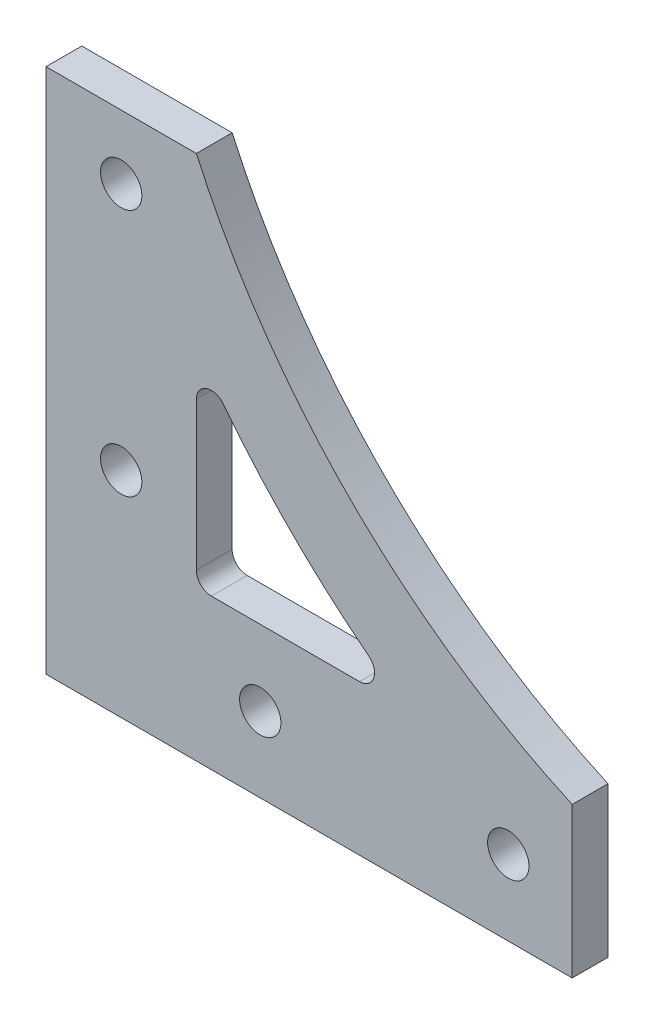
ISO-10303-21;
HEADER;
FILE_DESCRIPTION(('STEP AP214'),'2;1');
FILE_NAME('part.step','',(''),(''),'','','');
FILE_SCHEMA(('AUTOMOTIVE_DESIGN { 1 0 10303 214 1 1 1 1 }'));
ENDSEC;
DATA;
#1=APPLICATION_CONTEXT('core data for automotive mechanical design processes');
#2=APPLICATION_PROTOCOL_DEFINITION('international standard','automotive_design',2000,#1);
#3=PRODUCT_CONTEXT('',#1,'mechanical');
#4=PRODUCT('Part','Part','',(#3));
#5=PRODUCT_RELATED_PRODUCT_CATEGORY('part','',(#4));
#6=PRODUCT_DEFINITION_FORMATION('','',#4);
#7=PRODUCT_DEFINITION_CONTEXT('part definition',#1,'design');
#8=PRODUCT_DEFINITION('design','',#6,#7);
#9=PRODUCT_DEFINITION_SHAPE('','',#8);
#10=(LENGTH_UNIT() NAMED_UNIT(*) SI_UNIT(.MILLI.,.METRE.));
#11=(NAMED_UNIT(*) PLANE_ANGLE_UNIT() SI_UNIT($,.RADIAN.));
#12=(NAMED_UNIT(*) SI_UNIT($,.STERADIAN.) SOLID_ANGLE_UNIT());
#13=UNCERTAINTY_MEASURE_WITH_UNIT(LENGTH_MEASURE(1.E-05),#10,'distance_accuracy_value','');
#14=(GEOMETRIC_REPRESENTATION_CONTEXT(3) GLOBAL_UNCERTAINTY_ASSIGNED_CONTEXT((#13)) GLOBAL_UNIT_ASSIGNED_CONTEXT((#10,
#11,#12)) REPRESENTATION_CONTEXT('',''));
#15=CARTESIAN_POINT('',(0.,0.,0.));
#16=DIRECTION('',(0.,0.,1.));
#17=DIRECTION('',(1.,0.,0.));
#18=AXIS2_PLACEMENT_3D('',#15,#16,#17);
#19=CARTESIAN_POINT('',(111.143782776615,111.143782776615,4.7625));
#20=DIRECTION('',(0.,0.,1.));
#21=DIRECTION('',(1.,0.,0.));
#22=AXIS2_PLACEMENT_3D('',#19,#20,#21);
#23=PLANE('',#22);
#24=CARTESIAN_POINT('',(61.5,10.,4.7625));
#25=DIRECTION('',(0.,0.,1.));
#26=DIRECTION('',(1.,0.,0.));
#27=AXIS2_PLACEMENT_3D('',#24,#25,#26);
#28=CIRCLE('',#27,2.75);
#29=CARTESIAN_POINT('',(64.25,10.,4.7625));
#30=VERTEX_POINT('',#29);
#31=EDGE_CURVE('E166',#30,#30,#28,.T.);
#32=ORIENTED_EDGE('',*,*,#31,.F.);
#33=EDGE_LOOP('',(#32));
#34=FACE_BOUND('',#33,.T.);
#35=CARTESIAN_POINT('',(10.,28.5,4.7625));
#36=DIRECTION('',(0.,0.,1.));
#37=DIRECTION('',(1.,0.,0.));
#38=AXIS2_PLACEMENT_3D('',#35,#36,#37);
#39=CIRCLE('',#38,2.75);
#40=CARTESIAN_POINT('',(12.75,28.5,4.7625));
#41=VERTEX_POINT('',#40);
#42=EDGE_CURVE('E178',#41,#41,#39,.T.);
#43=ORIENTED_EDGE('',*,*,#42,.F.);
#44=EDGE_LOOP('',(#43));
#45=FACE_BOUND('',#44,.T.);
#46=DIRECTION('',(0.,-1.,0.));
#47=VECTOR('',#46,1.);
#48=CARTESIAN_POINT('',(0.,0.,4.7625));
#49=LINE('',#48,#47);
#50=CARTESIAN_POINT('',(0.,70.,4.7625));
#51=VERTEX_POINT('',#50);
#52=CARTESIAN_POINT('',(0.,0.,4.7625));
#53=VERTEX_POINT('',#52);
#54=EDGE_CURVE('E190',#51,#53,#49,.T.);
#55=ORIENTED_EDGE('',*,*,#54,.T.);
#56=DIRECTION('',(1.,0.,0.));
#57=VECTOR('',#56,1.);
#58=CARTESIAN_POINT('',(0.,0.,4.7625));
#59=LINE('',#58,#57);
#60=CARTESIAN_POINT('',(70.,0.,4.7625));
#61=VERTEX_POINT('',#60);
#62=EDGE_CURVE('E193',#53,#61,#59,.T.);
#63=ORIENTED_EDGE('',*,*,#62,.T.);
#64=DIRECTION('',(0.,1.,0.));
#65=VECTOR('',#64,1.);
#66=CARTESIAN_POINT('',(70.,0.,4.7625));
#67=LINE('',#66,#65);
#68=CARTESIAN_POINT('',(70.,20.,4.7625));
#69=VERTEX_POINT('',#68);
#70=EDGE_CURVE('E196',#61,#69,#67,.T.);
#71=ORIENTED_EDGE('',*,*,#70,.T.);
#72=CARTESIAN_POINT('',(111.143782776615,111.143782776615,4.7625));
#73=DIRECTION('',(0.,0.,-1.));
#74=DIRECTION('',(1.,0.,0.));
#75=AXIS2_PLACEMENT_3D('',#72,#73,#74);
#76=CIRCLE('',#75,100.);
#77=CARTESIAN_POINT('',(20.,70.,4.7625));
#78=VERTEX_POINT('',#77);
#79=EDGE_CURVE('E198',#69,#78,#76,.T.);
#80=ORIENTED_EDGE('',*,*,#79,.T.);
#81=DIRECTION('',(-1.,0.,0.));
#82=VECTOR('',#81,1.);
#83=CARTESIAN_POINT('',(0.,70.,4.7625));
#84=LINE('',#83,#82);
#85=EDGE_CURVE('E200',#78,#51,#84,.T.);
#86=ORIENTED_EDGE('',*,*,#85,.T.);
#87=EDGE_LOOP('',(#55,#63,#71,#80,#86));
#88=FACE_BOUND('',#87,.T.);
#89=CARTESIAN_POINT('',(10.,61.5,4.7625));
#90=DIRECTION('',(0.,0.,1.));
#91=DIRECTION('',(1.,0.,0.));
#92=AXIS2_PLACEMENT_3D('',#89,#90,#91);
#93=CIRCLE('',#92,2.75);
#94=CARTESIAN_POINT('',(12.75,61.5,4.7625));
#95=VERTEX_POINT('',#94);
#96=EDGE_CURVE('E184',#95,#95,#93,.T.);
#97=ORIENTED_EDGE('',*,*,#96,.F.);
#98=EDGE_LOOP('',(#97));
#99=FACE_BOUND('',#98,.T.);
#100=CARTESIAN_POINT('',(28.5,9.99999999999999,4.7625));
#101=DIRECTION('',(0.,0.,1.));
#102=DIRECTION('',(1.,0.,0.));
#103=AXIS2_PLACEMENT_3D('',#100,#101,#102);
#104=CIRCLE('',#103,2.74999999999999);
#105=CARTESIAN_POINT('',(31.25,9.99999999999999,4.7625));
#106=VERTEX_POINT('',#105);
#107=EDGE_CURVE('E172',#106,#106,#104,.T.);
#108=ORIENTED_EDGE('',*,*,#107,.F.);
#109=EDGE_LOOP('',(#108));
#110=FACE_BOUND('',#109,.T.);
#111=CARTESIAN_POINT('',(111.143782776615,111.143782776615,4.7625));
#112=DIRECTION('',(0.,0.,-1.));
#113=DIRECTION('',(1.,0.,0.));
#114=AXIS2_PLACEMENT_3D('',#111,#112,#113);
#115=CIRCLE('',#114,111.);
#116=CARTESIAN_POINT('',(42.9294681675539,23.5777660668428,4.7625));
#117=VERTEX_POINT('',#116);
#118=CARTESIAN_POINT('',(23.5777660668427,42.929468167554,4.7625));
#119=VERTEX_POINT('',#118);
#120=EDGE_CURVE('E123',#117,#119,#115,.T.);
#121=ORIENTED_EDGE('',*,*,#120,.F.);
#122=CARTESIAN_POINT('',(41.7003814178411,22.,4.7625));
#123=DIRECTION('',(0.,0.,1.));
#124=DIRECTION('',(1.,0.,0.));
#125=AXIS2_PLACEMENT_3D('',#122,#123,#124);
#126=CIRCLE('',#125,2.);
#127=CARTESIAN_POINT('',(41.7003814178411,20.,4.7625));
#128=VERTEX_POINT('',#127);
#129=EDGE_CURVE('E115',#128,#117,#126,.T.);
#130=ORIENTED_EDGE('',*,*,#129,.F.);
#131=DIRECTION('',(1.,0.,0.));
#132=VECTOR('',#131,1.);
#133=CARTESIAN_POINT('',(22.,20.,4.7625));
#134=LINE('',#133,#132);
#135=CARTESIAN_POINT('',(22.,20.,4.7625));
#136=VERTEX_POINT('',#135);
#137=EDGE_CURVE('E144',#136,#128,#134,.T.);
#138=ORIENTED_EDGE('',*,*,#137,.F.);
#139=CARTESIAN_POINT('',(22.,22.,4.7625));
#140=DIRECTION('',(0.,0.,1.));
#141=DIRECTION('',(1.,0.,0.));
#142=AXIS2_PLACEMENT_3D('',#139,#140,#141);
#143=CIRCLE('',#142,2.);
#144=CARTESIAN_POINT('',(20.,22.,4.7625));
#145=VERTEX_POINT('',#144);
#146=EDGE_CURVE('E142',#145,#136,#143,.T.);
#147=ORIENTED_EDGE('',*,*,#146,.F.);
#148=DIRECTION('',(0.,-1.,0.));
#149=VECTOR('',#148,1.);
#150=CARTESIAN_POINT('',(20.,41.7003814178412,4.7625));
#151=LINE('',#150,#149);
#152=CARTESIAN_POINT('',(20.,41.7003814178412,4.7625));
#153=VERTEX_POINT('',#152);
#154=EDGE_CURVE('E138',#153,#145,#151,.T.);
#155=ORIENTED_EDGE('',*,*,#154,.F.);
#156=CARTESIAN_POINT('',(22.,41.7003814178412,4.7625));
#157=DIRECTION('',(0.,0.,1.));
#158=DIRECTION('',(-1.,0.,0.));
#159=AXIS2_PLACEMENT_3D('',#156,#157,#158);
#160=CIRCLE('',#159,2.);
#161=EDGE_CURVE('E136',#119,#153,#160,.T.);
#162=ORIENTED_EDGE('',*,*,#161,.F.);
#163=EDGE_LOOP('',(#121,#130,#138,#147,#155,#162));
#164=FACE_BOUND('',#163,.T.);
#165=ADVANCED_FACE('F32',(#34,#45,#88,#99,#110,#164),#23,.T.);
#166=CARTESIAN_POINT('',(111.143782776615,111.143782776615,0.));
#167=DIRECTION('',(0.,0.,1.));
#168=DIRECTION('',(1.,0.,0.));
#169=AXIS2_PLACEMENT_3D('',#166,#167,#168);
#170=PLANE('',#169);
#171=CARTESIAN_POINT('',(61.5,10.,0.));
#172=DIRECTION('',(0.,0.,1.));
#173=DIRECTION('',(1.,0.,0.));
#174=AXIS2_PLACEMENT_3D('',#171,#172,#173);
#175=CIRCLE('',#174,2.75);
#176=CARTESIAN_POINT('',(64.25,10.,0.));
#177=VERTEX_POINT('',#176);
#178=EDGE_CURVE('E131',#177,#177,#175,.T.);
#179=ORIENTED_EDGE('',*,*,#178,.T.);
#180=EDGE_LOOP('',(#179));
#181=FACE_BOUND('',#180,.T.);
#182=CARTESIAN_POINT('',(10.,28.5,0.));
#183=DIRECTION('',(0.,0.,1.));
#184=DIRECTION('',(1.,0.,0.));
#185=AXIS2_PLACEMENT_3D('',#182,#183,#184);
#186=CIRCLE('',#185,2.75);
#187=CARTESIAN_POINT('',(12.75,28.5,0.));
#188=VERTEX_POINT('',#187);
#189=EDGE_CURVE('E175',#188,#188,#186,.T.);
#190=ORIENTED_EDGE('',*,*,#189,.T.);
#191=EDGE_LOOP('',(#190));
#192=FACE_BOUND('',#191,.T.);
#193=DIRECTION('',(0.,-1.,0.));
#194=VECTOR('',#193,1.);
#195=CARTESIAN_POINT('',(0.,0.,0.));
#196=LINE('',#195,#194);
#197=CARTESIAN_POINT('',(0.,70.,0.));
#198=VERTEX_POINT('',#197);
#199=CARTESIAN_POINT('',(0.,0.,0.));
#200=VERTEX_POINT('',#199);
#201=EDGE_CURVE('E187',#198,#200,#196,.T.);
#202=ORIENTED_EDGE('',*,*,#201,.F.);
#203=DIRECTION('',(-1.,0.,0.));
#204=VECTOR('',#203,1.);
#205=CARTESIAN_POINT('',(0.,70.,0.));
#206=LINE('',#205,#204);
#207=CARTESIAN_POINT('',(20.,70.,0.));
#208=VERTEX_POINT('',#207);
#209=EDGE_CURVE('E194',#208,#198,#206,.T.);
#210=ORIENTED_EDGE('',*,*,#209,.F.);
#211=CARTESIAN_POINT('',(111.143782776615,111.143782776615,0.));
#212=DIRECTION('',(0.,0.,-1.));
#213=DIRECTION('',(1.,0.,0.));
#214=AXIS2_PLACEMENT_3D('',#211,#212,#213);
#215=CIRCLE('',#214,100.);
#216=CARTESIAN_POINT('',(70.,20.,0.));
#217=VERTEX_POINT('',#216);
#218=EDGE_CURVE('E209',#217,#208,#215,.T.);
#219=ORIENTED_EDGE('',*,*,#218,.F.);
#220=DIRECTION('',(0.,1.,0.));
#221=VECTOR('',#220,1.);
#222=CARTESIAN_POINT('',(70.,0.,0.));
#223=LINE('',#222,#221);
#224=CARTESIAN_POINT('',(70.,0.,0.));
#225=VERTEX_POINT('',#224);
#226=EDGE_CURVE('E207',#225,#217,#223,.T.);
#227=ORIENTED_EDGE('',*,*,#226,.F.);
#228=DIRECTION('',(1.,0.,0.));
#229=VECTOR('',#228,1.);
#230=CARTESIAN_POINT('',(0.,0.,0.));
#231=LINE('',#230,#229);
#232=EDGE_CURVE('E205',#200,#225,#231,.T.);
#233=ORIENTED_EDGE('',*,*,#232,.F.);
#234=EDGE_LOOP('',(#202,#210,#219,#227,#233));
#235=FACE_BOUND('',#234,.T.);
#236=CARTESIAN_POINT('',(10.,61.5,0.));
#237=DIRECTION('',(0.,0.,1.));
#238=DIRECTION('',(1.,0.,0.));
#239=AXIS2_PLACEMENT_3D('',#236,#237,#238);
#240=CIRCLE('',#239,2.75);
#241=CARTESIAN_POINT('',(12.75,61.5,0.));
#242=VERTEX_POINT('',#241);
#243=EDGE_CURVE('E181',#242,#242,#240,.T.);
#244=ORIENTED_EDGE('',*,*,#243,.T.);
#245=EDGE_LOOP('',(#244));
#246=FACE_BOUND('',#245,.T.);
#247=CARTESIAN_POINT('',(28.5,9.99999999999999,0.));
#248=DIRECTION('',(0.,0.,1.));
#249=DIRECTION('',(1.,0.,0.));
#250=AXIS2_PLACEMENT_3D('',#247,#248,#249);
#251=CIRCLE('',#250,2.74999999999999);
#252=CARTESIAN_POINT('',(31.25,9.99999999999999,0.));
#253=VERTEX_POINT('',#252);
#254=EDGE_CURVE('E169',#253,#253,#251,.T.);
#255=ORIENTED_EDGE('',*,*,#254,.T.);
#256=EDGE_LOOP('',(#255));
#257=FACE_BOUND('',#256,.T.);
#258=CARTESIAN_POINT('',(41.7003814178411,22.,0.));
#259=DIRECTION('',(0.,0.,1.));
#260=DIRECTION('',(1.,0.,0.));
#261=AXIS2_PLACEMENT_3D('',#258,#259,#260);
#262=CIRCLE('',#261,2.);
#263=CARTESIAN_POINT('',(41.7003814178411,20.,0.));
#264=VERTEX_POINT('',#263);
#265=CARTESIAN_POINT('',(42.9294681675539,23.5777660668428,0.));
#266=VERTEX_POINT('',#265);
#267=EDGE_CURVE('E55',#264,#266,#262,.T.);
#268=ORIENTED_EDGE('',*,*,#267,.T.);
#269=CARTESIAN_POINT('',(111.143782776615,111.143782776615,0.));
#270=DIRECTION('',(0.,0.,-1.));
#271=DIRECTION('',(1.,0.,0.));
#272=AXIS2_PLACEMENT_3D('',#269,#270,#271);
#273=CIRCLE('',#272,111.);
#274=CARTESIAN_POINT('',(23.5777660668427,42.929468167554,0.));
#275=VERTEX_POINT('',#274);
#276=EDGE_CURVE('E130',#266,#275,#273,.T.);
#277=ORIENTED_EDGE('',*,*,#276,.T.);
#278=CARTESIAN_POINT('',(22.,41.7003814178412,0.));
#279=DIRECTION('',(0.,0.,1.));
#280=DIRECTION('',(-1.,0.,0.));
#281=AXIS2_PLACEMENT_3D('',#278,#279,#280);
#282=CIRCLE('',#281,2.);
#283=CARTESIAN_POINT('',(20.,41.7003814178412,0.));
#284=VERTEX_POINT('',#283);
#285=EDGE_CURVE('E148',#275,#284,#282,.T.);
#286=ORIENTED_EDGE('',*,*,#285,.T.);
#287=DIRECTION('',(0.,-1.,0.));
#288=VECTOR('',#287,1.);
#289=CARTESIAN_POINT('',(20.,41.7003814178412,0.));
#290=LINE('',#289,#288);
#291=CARTESIAN_POINT('',(20.,22.,0.));
#292=VERTEX_POINT('',#291);
#293=EDGE_CURVE('E151',#284,#292,#290,.T.);
#294=ORIENTED_EDGE('',*,*,#293,.T.);
#295=CARTESIAN_POINT('',(22.,22.,0.));
#296=DIRECTION('',(0.,0.,1.));
#297=DIRECTION('',(1.,0.,0.));
#298=AXIS2_PLACEMENT_3D('',#295,#296,#297);
#299=CIRCLE('',#298,2.);
#300=CARTESIAN_POINT('',(22.,20.,0.));
#301=VERTEX_POINT('',#300);
#302=EDGE_CURVE('E154',#292,#301,#299,.T.);
#303=ORIENTED_EDGE('',*,*,#302,.T.);
#304=DIRECTION('',(1.,0.,0.));
#305=VECTOR('',#304,1.);
#306=CARTESIAN_POINT('',(22.,20.,0.));
#307=LINE('',#306,#305);
#308=EDGE_CURVE('E124',#301,#264,#307,.T.);
#309=ORIENTED_EDGE('',*,*,#308,.T.);
#310=EDGE_LOOP('',(#268,#277,#286,#294,#303,#309));
#311=FACE_BOUND('',#310,.T.);
#312=ADVANCED_FACE('F230',(#181,#192,#235,#246,#257,#311),#170,.F.);
#313=CARTESIAN_POINT('',(0.,0.,4.7625));
#314=DIRECTION('',(1.,0.,0.));
#315=DIRECTION('',(0.,0.,-1.));
#316=AXIS2_PLACEMENT_3D('',#313,#314,#315);
#317=PLANE('',#316);
#318=ORIENTED_EDGE('',*,*,#201,.T.);
#319=DIRECTION('',(0.,0.,-1.));
#320=VECTOR('',#319,1.);
#321=CARTESIAN_POINT('',(0.,0.,4.7625));
#322=LINE('',#321,#320);
#323=EDGE_CURVE('E11',#53,#200,#322,.T.);
#324=ORIENTED_EDGE('',*,*,#323,.F.);
#325=ORIENTED_EDGE('',*,*,#54,.F.);
#326=DIRECTION('',(0.,0.,-1.));
#327=VECTOR('',#326,1.);
#328=CARTESIAN_POINT('',(0.,70.,4.7625));
#329=LINE('',#328,#327);
#330=EDGE_CURVE('E202',#51,#198,#329,.T.);
#331=ORIENTED_EDGE('',*,*,#330,.T.);
#332=EDGE_LOOP('',(#318,#324,#325,#331));
#333=FACE_BOUND('',#332,.T.);
#334=ADVANCED_FACE('F34',(#333),#317,.F.);
#335=CARTESIAN_POINT('',(0.,0.,4.7625));
#336=DIRECTION('',(0.,1.,0.));
#337=DIRECTION('',(0.,0.,1.));
#338=AXIS2_PLACEMENT_3D('',#335,#336,#337);
#339=PLANE('',#338);
#340=ORIENTED_EDGE('',*,*,#232,.T.);
#341=DIRECTION('',(0.,0.,-1.));
#342=VECTOR('',#341,1.);
#343=CARTESIAN_POINT('',(70.,0.,4.7625));
#344=LINE('',#343,#342);
#345=EDGE_CURVE('E40',#61,#225,#344,.T.);
#346=ORIENTED_EDGE('',*,*,#345,.F.);
#347=ORIENTED_EDGE('',*,*,#62,.F.);
#348=ORIENTED_EDGE('',*,*,#323,.T.);
#349=EDGE_LOOP('',(#340,#346,#347,#348));
#350=FACE_BOUND('',#349,.T.);
#351=ADVANCED_FACE('F245',(#350),#339,.F.);
#352=CARTESIAN_POINT('',(70.,0.,4.7625));
#353=DIRECTION('',(-1.,0.,0.));
#354=DIRECTION('',(0.,0.,1.));
#355=AXIS2_PLACEMENT_3D('',#352,#353,#354);
#356=PLANE('',#355);
#357=ORIENTED_EDGE('',*,*,#226,.T.);
#358=DIRECTION('',(0.,0.,-1.));
#359=VECTOR('',#358,1.);
#360=CARTESIAN_POINT('',(70.,20.,4.7625));
#361=LINE('',#360,#359);
#362=EDGE_CURVE('E217',#69,#217,#361,.T.);
#363=ORIENTED_EDGE('',*,*,#362,.F.);
#364=ORIENTED_EDGE('',*,*,#70,.F.);
#365=ORIENTED_EDGE('',*,*,#345,.T.);
#366=EDGE_LOOP('',(#357,#363,#364,#365));
#367=FACE_BOUND('',#366,.T.);
#368=ADVANCED_FACE('F224',(#367),#356,.F.);
#369=CARTESIAN_POINT('',(111.143782776615,111.143782776615,4.7625));
#370=DIRECTION('',(0.,0.,-1.));
#371=DIRECTION('',(-1.,0.,0.));
#372=AXIS2_PLACEMENT_3D('',#369,#370,#371);
#373=CYLINDRICAL_SURFACE('',#372,100.);
#374=ORIENTED_EDGE('',*,*,#218,.T.);
#375=DIRECTION('',(0.,0.,-1.));
#376=VECTOR('',#375,1.);
#377=CARTESIAN_POINT('',(20.,70.,4.7625));
#378=LINE('',#377,#376);
#379=EDGE_CURVE('E214',#78,#208,#378,.T.);
#380=ORIENTED_EDGE('',*,*,#379,.F.);
#381=ORIENTED_EDGE('',*,*,#79,.F.);
#382=ORIENTED_EDGE('',*,*,#362,.T.);
#383=EDGE_LOOP('',(#374,#380,#381,#382));
#384=FACE_BOUND('',#383,.T.);
#385=ADVANCED_FACE('F235',(#384),#373,.F.);
#386=CARTESIAN_POINT('',(0.,70.,4.7625));
#387=DIRECTION('',(0.,-1.,0.));
#388=DIRECTION('',(0.,0.,-1.));
#389=AXIS2_PLACEMENT_3D('',#386,#387,#388);
#390=PLANE('',#389);
#391=ORIENTED_EDGE('',*,*,#209,.T.);
#392=ORIENTED_EDGE('',*,*,#330,.F.);
#393=ORIENTED_EDGE('',*,*,#85,.F.);
#394=ORIENTED_EDGE('',*,*,#379,.T.);
#395=EDGE_LOOP('',(#391,#392,#393,#394));
#396=FACE_BOUND('',#395,.T.);
#397=ADVANCED_FACE('F239',(#396),#390,.F.);
#398=CARTESIAN_POINT('',(10.,61.5,4.7625));
#399=DIRECTION('',(0.,0.,-1.));
#400=DIRECTION('',(-1.,0.,0.));
#401=AXIS2_PLACEMENT_3D('',#398,#399,#400);
#402=CYLINDRICAL_SURFACE('',#401,2.75);
#403=ORIENTED_EDGE('',*,*,#96,.T.);
#404=EDGE_LOOP('',(#403));
#405=FACE_BOUND('',#404,.T.);
#406=ORIENTED_EDGE('',*,*,#243,.F.);
#407=EDGE_LOOP('',(#406));
#408=FACE_BOUND('',#407,.T.);
#409=ADVANCED_FACE('F262',(#405,#408),#402,.F.);
#410=CARTESIAN_POINT('',(10.,28.5,4.7625));
#411=DIRECTION('',(0.,0.,-1.));
#412=DIRECTION('',(-1.,0.,0.));
#413=AXIS2_PLACEMENT_3D('',#410,#411,#412);
#414=CYLINDRICAL_SURFACE('',#413,2.75);
#415=ORIENTED_EDGE('',*,*,#42,.T.);
#416=EDGE_LOOP('',(#415));
#417=FACE_BOUND('',#416,.T.);
#418=ORIENTED_EDGE('',*,*,#189,.F.);
#419=EDGE_LOOP('',(#418));
#420=FACE_BOUND('',#419,.T.);
#421=ADVANCED_FACE('F288',(#417,#420),#414,.F.);
#422=CARTESIAN_POINT('',(28.5,9.99999999999999,4.7625));
#423=DIRECTION('',(0.,0.,-1.));
#424=DIRECTION('',(-1.,0.,0.));
#425=AXIS2_PLACEMENT_3D('',#422,#423,#424);
#426=CYLINDRICAL_SURFACE('',#425,2.74999999999999);
#427=ORIENTED_EDGE('',*,*,#107,.T.);
#428=EDGE_LOOP('',(#427));
#429=FACE_BOUND('',#428,.T.);
#430=ORIENTED_EDGE('',*,*,#254,.F.);
#431=EDGE_LOOP('',(#430));
#432=FACE_BOUND('',#431,.T.);
#433=ADVANCED_FACE('F295',(#429,#432),#426,.F.);
#434=CARTESIAN_POINT('',(61.5,10.,4.7625));
#435=DIRECTION('',(0.,0.,-1.));
#436=DIRECTION('',(-1.,0.,0.));
#437=AXIS2_PLACEMENT_3D('',#434,#435,#436);
#438=CYLINDRICAL_SURFACE('',#437,2.75);
#439=ORIENTED_EDGE('',*,*,#31,.T.);
#440=EDGE_LOOP('',(#439));
#441=FACE_BOUND('',#440,.T.);
#442=ORIENTED_EDGE('',*,*,#178,.F.);
#443=EDGE_LOOP('',(#442));
#444=FACE_BOUND('',#443,.T.);
#445=ADVANCED_FACE('F302',(#441,#444),#438,.F.);
#446=CARTESIAN_POINT('',(41.7003814178411,22.,4.7625));
#447=DIRECTION('',(0.,0.,-1.));
#448=DIRECTION('',(-1.,0.,0.));
#449=AXIS2_PLACEMENT_3D('',#446,#447,#448);
#450=CYLINDRICAL_SURFACE('',#449,2.);
#451=ORIENTED_EDGE('',*,*,#267,.F.);
#452=DIRECTION('',(0.,0.,-1.));
#453=VECTOR('',#452,1.);
#454=CARTESIAN_POINT('',(41.7003814178411,20.,4.7625));
#455=LINE('',#454,#453);
#456=EDGE_CURVE('E119',#128,#264,#455,.T.);
#457=ORIENTED_EDGE('',*,*,#456,.F.);
#458=ORIENTED_EDGE('',*,*,#129,.T.);
#459=DIRECTION('',(0.,0.,-1.));
#460=VECTOR('',#459,1.);
#461=CARTESIAN_POINT('',(42.9294681675539,23.5777660668428,4.7625));
#462=LINE('',#461,#460);
#463=EDGE_CURVE('E118',#117,#266,#462,.T.);
#464=ORIENTED_EDGE('',*,*,#463,.T.);
#465=EDGE_LOOP('',(#451,#457,#458,#464));
#466=FACE_BOUND('',#465,.T.);
#467=ADVANCED_FACE('F117',(#466),#450,.F.);
#468=CARTESIAN_POINT('',(111.143782776615,111.143782776615,4.7625));
#469=DIRECTION('',(0.,0.,-1.));
#470=DIRECTION('',(-1.,0.,0.));
#471=AXIS2_PLACEMENT_3D('',#468,#469,#470);
#472=CYLINDRICAL_SURFACE('',#471,111.);
#473=ORIENTED_EDGE('',*,*,#276,.F.);
#474=ORIENTED_EDGE('',*,*,#463,.F.);
#475=ORIENTED_EDGE('',*,*,#120,.T.);
#476=DIRECTION('',(0.,0.,-1.));
#477=VECTOR('',#476,1.);
#478=CARTESIAN_POINT('',(23.5777660668427,42.929468167554,4.7625));
#479=LINE('',#478,#477);
#480=EDGE_CURVE('E132',#119,#275,#479,.T.);
#481=ORIENTED_EDGE('',*,*,#480,.T.);
#482=EDGE_LOOP('',(#473,#474,#475,#481));
#483=FACE_BOUND('',#482,.T.);
#484=ADVANCED_FACE('F127',(#483),#472,.T.);
#485=CARTESIAN_POINT('',(22.,41.7003814178412,4.7625));
#486=DIRECTION('',(0.,0.,-1.));
#487=DIRECTION('',(-1.,0.,0.));
#488=AXIS2_PLACEMENT_3D('',#485,#486,#487);
#489=CYLINDRICAL_SURFACE('',#488,2.);
#490=ORIENTED_EDGE('',*,*,#285,.F.);
#491=ORIENTED_EDGE('',*,*,#480,.F.);
#492=ORIENTED_EDGE('',*,*,#161,.T.);
#493=DIRECTION('',(0.,0.,-1.));
#494=VECTOR('',#493,1.);
#495=CARTESIAN_POINT('',(20.,41.7003814178412,4.7625));
#496=LINE('',#495,#494);
#497=EDGE_CURVE('E163',#153,#284,#496,.T.);
#498=ORIENTED_EDGE('',*,*,#497,.T.);
#499=EDGE_LOOP('',(#490,#491,#492,#498));
#500=FACE_BOUND('',#499,.T.);
#501=ADVANCED_FACE('F323',(#500),#489,.F.);
#502=CARTESIAN_POINT('',(20.,41.7003814178412,4.7625));
#503=DIRECTION('',(1.,0.,0.));
#504=DIRECTION('',(0.,1.,0.));
#505=AXIS2_PLACEMENT_3D('',#502,#503,#504);
#506=PLANE('',#505);
#507=ORIENTED_EDGE('',*,*,#293,.F.);
#508=ORIENTED_EDGE('',*,*,#497,.F.);
#509=ORIENTED_EDGE('',*,*,#154,.T.);
#510=DIRECTION('',(0.,0.,-1.));
#511=VECTOR('',#510,1.);
#512=CARTESIAN_POINT('',(20.,22.,4.7625));
#513=LINE('',#512,#511);
#514=EDGE_CURVE('E161',#145,#292,#513,.T.);
#515=ORIENTED_EDGE('',*,*,#514,.T.);
#516=EDGE_LOOP('',(#507,#508,#509,#515));
#517=FACE_BOUND('',#516,.T.);
#518=ADVANCED_FACE('F330',(#517),#506,.T.);
#519=CARTESIAN_POINT('',(22.,22.,4.7625));
#520=DIRECTION('',(0.,0.,-1.));
#521=DIRECTION('',(-1.,0.,0.));
#522=AXIS2_PLACEMENT_3D('',#519,#520,#521);
#523=CYLINDRICAL_SURFACE('',#522,2.);
#524=ORIENTED_EDGE('',*,*,#302,.F.);
#525=ORIENTED_EDGE('',*,*,#514,.F.);
#526=ORIENTED_EDGE('',*,*,#146,.T.);
#527=DIRECTION('',(0.,0.,-1.));
#528=VECTOR('',#527,1.);
#529=CARTESIAN_POINT('',(22.,20.,4.7625));
#530=LINE('',#529,#528);
#531=EDGE_CURVE('E47',#136,#301,#530,.T.);
#532=ORIENTED_EDGE('',*,*,#531,.T.);
#533=EDGE_LOOP('',(#524,#525,#526,#532));
#534=FACE_BOUND('',#533,.T.);
#535=ADVANCED_FACE('F338',(#534),#523,.F.);
#536=CARTESIAN_POINT('',(22.,20.,4.7625));
#537=DIRECTION('',(0.,1.,0.));
#538=DIRECTION('',(-1.,0.,0.));
#539=AXIS2_PLACEMENT_3D('',#536,#537,#538);
#540=PLANE('',#539);
#541=ORIENTED_EDGE('',*,*,#308,.F.);
#542=ORIENTED_EDGE('',*,*,#531,.F.);
#543=ORIENTED_EDGE('',*,*,#137,.T.);
#544=ORIENTED_EDGE('',*,*,#456,.T.);
#545=EDGE_LOOP('',(#541,#542,#543,#544));
#546=FACE_BOUND('',#545,.T.);
#547=ADVANCED_FACE('F346',(#546),#540,.T.);
#548=CLOSED_SHELL('',(#165,#312,#334,#351,#368,#385,#397,#409,#421,#433,#445,#467,#484,#501,
#518,#535,#547));
#549=MANIFOLD_SOLID_BREP('B2',#548);
#550=ADVANCED_BREP_SHAPE_REPRESENTATION('',(#18,#549),#14);
#551=SHAPE_DEFINITION_REPRESENTATION(#9,#550);
ENDSEC;
END-ISO-10303-21;
